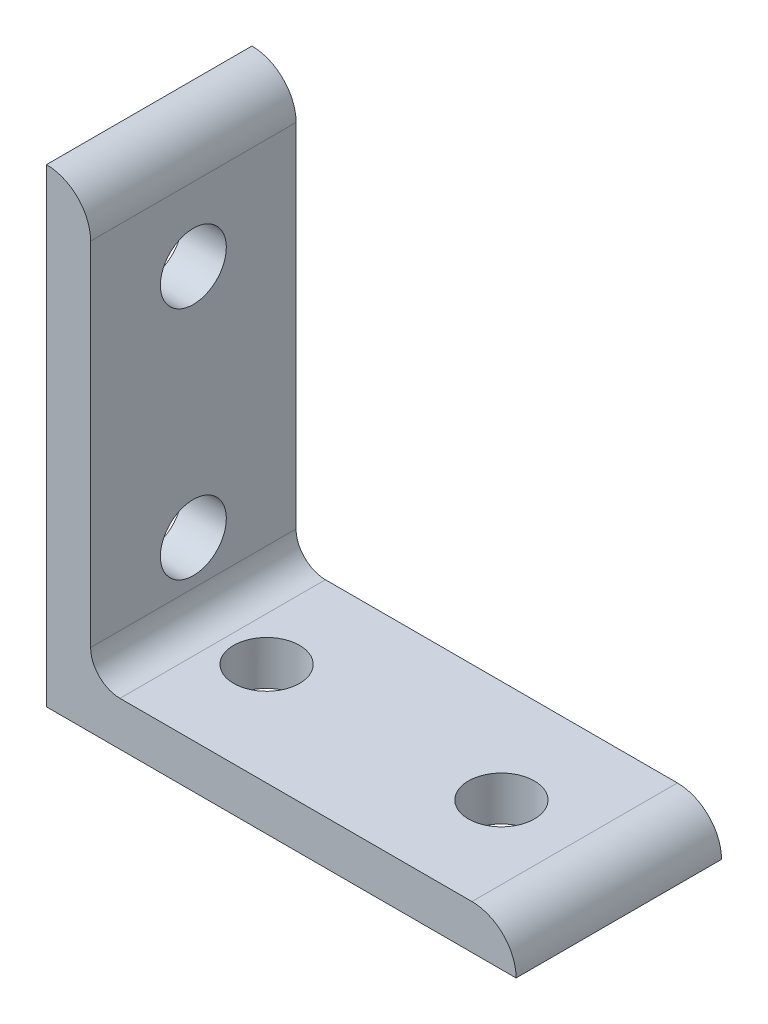
ISO-10303-21;
HEADER;
FILE_DESCRIPTION(('STEP AP214'),'2;1');
FILE_NAME('part.step','',(''),(''),'','','');
FILE_SCHEMA(('AUTOMOTIVE_DESIGN { 1 0 10303 214 1 1 1 1 }'));
ENDSEC;
DATA;
#1=APPLICATION_CONTEXT('core data for automotive mechanical design processes');
#2=APPLICATION_PROTOCOL_DEFINITION('international standard','automotive_design',2000,#1);
#3=PRODUCT_CONTEXT('',#1,'mechanical');
#4=PRODUCT('Part','Part','',(#3));
#5=PRODUCT_RELATED_PRODUCT_CATEGORY('part','',(#4));
#6=PRODUCT_DEFINITION_FORMATION('','',#4);
#7=PRODUCT_DEFINITION_CONTEXT('part definition',#1,'design');
#8=PRODUCT_DEFINITION('design','',#6,#7);
#9=PRODUCT_DEFINITION_SHAPE('','',#8);
#10=(LENGTH_UNIT() NAMED_UNIT(*) SI_UNIT(.MILLI.,.METRE.));
#11=(NAMED_UNIT(*) PLANE_ANGLE_UNIT() SI_UNIT($,.RADIAN.));
#12=(NAMED_UNIT(*) SI_UNIT($,.STERADIAN.) SOLID_ANGLE_UNIT());
#13=UNCERTAINTY_MEASURE_WITH_UNIT(LENGTH_MEASURE(1.E-05),#10,'distance_accuracy_value','');
#14=(GEOMETRIC_REPRESENTATION_CONTEXT(3) GLOBAL_UNCERTAINTY_ASSIGNED_CONTEXT((#13)) GLOBAL_UNIT_ASSIGNED_CONTEXT((#10,
#11,#12)) REPRESENTATION_CONTEXT('',''));
#15=CARTESIAN_POINT('',(0.,0.,0.));
#16=DIRECTION('',(0.,0.,1.));
#17=DIRECTION('',(1.,0.,0.));
#18=AXIS2_PLACEMENT_3D('',#15,#16,#17);
#19=CARTESIAN_POINT('',(4.7752,46.0248,11.1125));
#20=DIRECTION('',(-1.,0.,0.));
#21=DIRECTION('',(0.,-1.,0.));
#22=AXIS2_PLACEMENT_3D('',#19,#20,#21);
#23=PLANE('',#22);
#24=CARTESIAN_POINT('',(4.7752,12.7,0.));
#25=DIRECTION('',(-1.,0.,0.));
#26=DIRECTION('',(0.,-1.,0.));
#27=AXIS2_PLACEMENT_3D('',#24,#25,#26);
#28=CIRCLE('',#27,3.5687);
#29=CARTESIAN_POINT('',(4.7752,9.1313,0.));
#30=VERTEX_POINT('',#29);
#31=EDGE_CURVE('E196',#30,#30,#28,.F.);
#32=ORIENTED_EDGE('',*,*,#31,.F.);
#33=EDGE_LOOP('',(#32));
#34=FACE_BOUND('',#33,.T.);
#35=DIRECTION('',(0.,1.,0.));
#36=VECTOR('',#35,1.);
#37=CARTESIAN_POINT('',(4.7752,46.0248,-11.1125));
#38=LINE('',#37,#36);
#39=CARTESIAN_POINT('',(4.7752,7.9502,-11.1125));
#40=VERTEX_POINT('',#39);
#41=CARTESIAN_POINT('',(4.77519999999999,46.0248,-11.1125));
#42=VERTEX_POINT('',#41);
#43=EDGE_CURVE('E117',#40,#42,#38,.T.);
#44=ORIENTED_EDGE('',*,*,#43,.T.);
#45=DIRECTION('',(0.,0.,-1.));
#46=VECTOR('',#45,1.);
#47=CARTESIAN_POINT('',(4.77519999999999,46.0248,11.1125));
#48=LINE('',#47,#46);
#49=CARTESIAN_POINT('',(4.77519999999999,46.0248,11.1125));
#50=VERTEX_POINT('',#49);
#51=EDGE_CURVE('E114',#50,#42,#48,.T.);
#52=ORIENTED_EDGE('',*,*,#51,.F.);
#53=DIRECTION('',(0.,1.,0.));
#54=VECTOR('',#53,1.);
#55=CARTESIAN_POINT('',(4.7752,46.0248,11.1125));
#56=LINE('',#55,#54);
#57=CARTESIAN_POINT('',(4.7752,7.9502,11.1125));
#58=VERTEX_POINT('',#57);
#59=EDGE_CURVE('E103',#58,#50,#56,.T.);
#60=ORIENTED_EDGE('',*,*,#59,.F.);
#61=DIRECTION('',(0.,0.,-1.));
#62=VECTOR('',#61,1.);
#63=CARTESIAN_POINT('',(4.7752,7.9502,11.1125));
#64=LINE('',#63,#62);
#65=EDGE_CURVE('E118',#58,#40,#64,.T.);
#66=ORIENTED_EDGE('',*,*,#65,.T.);
#67=EDGE_LOOP('',(#44,#52,#60,#66));
#68=FACE_BOUND('',#67,.T.);
#69=CARTESIAN_POINT('',(4.77519999999999,38.1,0.));
#70=DIRECTION('',(-1.,0.,0.));
#71=DIRECTION('',(0.,-1.,0.));
#72=AXIS2_PLACEMENT_3D('',#69,#70,#71);
#73=CIRCLE('',#72,3.5687);
#74=CARTESIAN_POINT('',(4.77519999999999,34.5313,0.));
#75=VERTEX_POINT('',#74);
#76=EDGE_CURVE('E189',#75,#75,#73,.F.);
#77=ORIENTED_EDGE('',*,*,#76,.F.);
#78=EDGE_LOOP('',(#77));
#79=FACE_BOUND('',#78,.T.);
#80=ADVANCED_FACE('F34',(#34,#68,#79),#23,.F.);
#81=CARTESIAN_POINT('',(0.,0.,11.1125));
#82=DIRECTION('',(1.,0.,0.));
#83=DIRECTION('',(0.,0.,-1.));
#84=AXIS2_PLACEMENT_3D('',#81,#82,#83);
#85=PLANE('',#84);
#86=CARTESIAN_POINT('',(0.,12.7,0.));
#87=DIRECTION('',(1.,0.,0.));
#88=DIRECTION('',(0.,0.,-1.));
#89=AXIS2_PLACEMENT_3D('',#86,#87,#88);
#90=CIRCLE('',#89,3.5687);
#91=CARTESIAN_POINT('',(0.,12.7,-3.5687));
#92=VERTEX_POINT('',#91);
#93=EDGE_CURVE('E192',#92,#92,#90,.T.);
#94=ORIENTED_EDGE('',*,*,#93,.T.);
#95=EDGE_LOOP('',(#94));
#96=FACE_BOUND('',#95,.T.);
#97=DIRECTION('',(0.,-1.,0.));
#98=VECTOR('',#97,1.);
#99=CARTESIAN_POINT('',(0.,0.,-11.1125));
#100=LINE('',#99,#98);
#101=CARTESIAN_POINT('',(0.,50.8,-11.1125));
#102=VERTEX_POINT('',#101);
#103=CARTESIAN_POINT('',(0.,0.,-11.1125));
#104=VERTEX_POINT('',#103);
#105=EDGE_CURVE('E85',#102,#104,#100,.T.);
#106=ORIENTED_EDGE('',*,*,#105,.T.);
#107=DIRECTION('',(0.,0.,-1.));
#108=VECTOR('',#107,1.);
#109=CARTESIAN_POINT('',(0.,0.,11.1125));
#110=LINE('',#109,#108);
#111=CARTESIAN_POINT('',(0.,0.,11.1125));
#112=VERTEX_POINT('',#111);
#113=EDGE_CURVE('E123',#112,#104,#110,.T.);
#114=ORIENTED_EDGE('',*,*,#113,.F.);
#115=DIRECTION('',(0.,-1.,0.));
#116=VECTOR('',#115,1.);
#117=CARTESIAN_POINT('',(0.,0.,11.1125));
#118=LINE('',#117,#116);
#119=CARTESIAN_POINT('',(0.,50.8,11.1125));
#120=VERTEX_POINT('',#119);
#121=EDGE_CURVE('E53',#120,#112,#118,.T.);
#122=ORIENTED_EDGE('',*,*,#121,.F.);
#123=DIRECTION('',(0.,0.,-1.));
#124=VECTOR('',#123,1.);
#125=CARTESIAN_POINT('',(0.,50.8,11.1125));
#126=LINE('',#125,#124);
#127=EDGE_CURVE('E119',#120,#102,#126,.T.);
#128=ORIENTED_EDGE('',*,*,#127,.T.);
#129=EDGE_LOOP('',(#106,#114,#122,#128));
#130=FACE_BOUND('',#129,.T.);
#131=CARTESIAN_POINT('',(0.,38.1,0.));
#132=DIRECTION('',(1.,0.,0.));
#133=DIRECTION('',(0.,0.,-1.));
#134=AXIS2_PLACEMENT_3D('',#131,#132,#133);
#135=CIRCLE('',#134,3.5687);
#136=CARTESIAN_POINT('',(0.,38.1,-3.5687));
#137=VERTEX_POINT('',#136);
#138=EDGE_CURVE('E187',#137,#137,#135,.T.);
#139=ORIENTED_EDGE('',*,*,#138,.T.);
#140=EDGE_LOOP('',(#139));
#141=FACE_BOUND('',#140,.T.);
#142=ADVANCED_FACE('F180',(#96,#130,#141),#85,.F.);
#143=CARTESIAN_POINT('',(50.8,0.,11.1125));
#144=DIRECTION('',(0.,1.,0.));
#145=DIRECTION('',(-1.,0.,0.));
#146=AXIS2_PLACEMENT_3D('',#143,#144,#145);
#147=PLANE('',#146);
#148=CARTESIAN_POINT('',(12.7,0.,0.));
#149=DIRECTION('',(0.,1.,0.));
#150=DIRECTION('',(0.,0.,1.));
#151=AXIS2_PLACEMENT_3D('',#148,#149,#150);
#152=CIRCLE('',#151,3.5687);
#153=CARTESIAN_POINT('',(12.7,0.,3.5687));
#154=VERTEX_POINT('',#153);
#155=EDGE_CURVE('E149',#154,#154,#152,.T.);
#156=ORIENTED_EDGE('',*,*,#155,.T.);
#157=EDGE_LOOP('',(#156));
#158=FACE_BOUND('',#157,.T.);
#159=DIRECTION('',(1.,0.,0.));
#160=VECTOR('',#159,1.);
#161=CARTESIAN_POINT('',(50.8,0.,-11.1125));
#162=LINE('',#161,#160);
#163=CARTESIAN_POINT('',(50.8,0.,-11.1125));
#164=VERTEX_POINT('',#163);
#165=EDGE_CURVE('E127',#104,#164,#162,.T.);
#166=ORIENTED_EDGE('',*,*,#165,.T.);
#167=DIRECTION('',(0.,0.,-1.));
#168=VECTOR('',#167,1.);
#169=CARTESIAN_POINT('',(50.8,0.,11.1125));
#170=LINE('',#169,#168);
#171=CARTESIAN_POINT('',(50.8,0.,11.1125));
#172=VERTEX_POINT('',#171);
#173=EDGE_CURVE('E11',#172,#164,#170,.T.);
#174=ORIENTED_EDGE('',*,*,#173,.F.);
#175=DIRECTION('',(1.,0.,0.));
#176=VECTOR('',#175,1.);
#177=CARTESIAN_POINT('',(50.8,0.,11.1125));
#178=LINE('',#177,#176);
#179=EDGE_CURVE('E140',#112,#172,#178,.T.);
#180=ORIENTED_EDGE('',*,*,#179,.F.);
#181=ORIENTED_EDGE('',*,*,#113,.T.);
#182=EDGE_LOOP('',(#166,#174,#180,#181));
#183=FACE_BOUND('',#182,.T.);
#184=CARTESIAN_POINT('',(38.1,0.,0.));
#185=DIRECTION('',(0.,1.,0.));
#186=DIRECTION('',(0.,0.,1.));
#187=AXIS2_PLACEMENT_3D('',#184,#185,#186);
#188=CIRCLE('',#187,3.56869999999999);
#189=CARTESIAN_POINT('',(38.1,0.,3.56869999999999));
#190=VERTEX_POINT('',#189);
#191=EDGE_CURVE('E157',#190,#190,#188,.T.);
#192=ORIENTED_EDGE('',*,*,#191,.T.);
#193=EDGE_LOOP('',(#192));
#194=FACE_BOUND('',#193,.T.);
#195=ADVANCED_FACE('F36',(#158,#183,#194),#147,.F.);
#196=CARTESIAN_POINT('',(7.9502,4.7752,11.1125));
#197=DIRECTION('',(0.,-1.,0.));
#198=DIRECTION('',(1.,0.,0.));
#199=AXIS2_PLACEMENT_3D('',#196,#197,#198);
#200=PLANE('',#199);
#201=CARTESIAN_POINT('',(12.7,4.7752,0.));
#202=DIRECTION('',(0.,-1.,0.));
#203=DIRECTION('',(1.,0.,0.));
#204=AXIS2_PLACEMENT_3D('',#201,#202,#203);
#205=CIRCLE('',#204,3.5687);
#206=CARTESIAN_POINT('',(16.2687,4.7752,0.));
#207=VERTEX_POINT('',#206);
#208=EDGE_CURVE('E131',#207,#207,#205,.F.);
#209=ORIENTED_EDGE('',*,*,#208,.F.);
#210=EDGE_LOOP('',(#209));
#211=FACE_BOUND('',#210,.T.);
#212=DIRECTION('',(-1.,0.,0.));
#213=VECTOR('',#212,1.);
#214=CARTESIAN_POINT('',(7.9502,4.7752,-11.1125));
#215=LINE('',#214,#213);
#216=CARTESIAN_POINT('',(46.0248,4.7752,-11.1125));
#217=VERTEX_POINT('',#216);
#218=CARTESIAN_POINT('',(7.9502,4.7752,-11.1125));
#219=VERTEX_POINT('',#218);
#220=EDGE_CURVE('E133',#217,#219,#215,.T.);
#221=ORIENTED_EDGE('',*,*,#220,.T.);
#222=DIRECTION('',(0.,0.,-1.));
#223=VECTOR('',#222,1.);
#224=CARTESIAN_POINT('',(7.9502,4.7752,11.1125));
#225=LINE('',#224,#223);
#226=CARTESIAN_POINT('',(7.9502,4.7752,11.1125));
#227=VERTEX_POINT('',#226);
#228=EDGE_CURVE('E144',#227,#219,#225,.T.);
#229=ORIENTED_EDGE('',*,*,#228,.F.);
#230=DIRECTION('',(-1.,0.,0.));
#231=VECTOR('',#230,1.);
#232=CARTESIAN_POINT('',(7.9502,4.7752,11.1125));
#233=LINE('',#232,#231);
#234=CARTESIAN_POINT('',(46.0248,4.7752,11.1125));
#235=VERTEX_POINT('',#234);
#236=EDGE_CURVE('E163',#235,#227,#233,.T.);
#237=ORIENTED_EDGE('',*,*,#236,.F.);
#238=DIRECTION('',(0.,0.,-1.));
#239=VECTOR('',#238,1.);
#240=CARTESIAN_POINT('',(46.0248,4.7752,11.1125));
#241=LINE('',#240,#239);
#242=EDGE_CURVE('E44',#235,#217,#241,.T.);
#243=ORIENTED_EDGE('',*,*,#242,.T.);
#244=EDGE_LOOP('',(#221,#229,#237,#243));
#245=FACE_BOUND('',#244,.T.);
#246=CARTESIAN_POINT('',(38.1,4.7752,0.));
#247=DIRECTION('',(0.,-1.,0.));
#248=DIRECTION('',(1.,0.,0.));
#249=AXIS2_PLACEMENT_3D('',#246,#247,#248);
#250=CIRCLE('',#249,3.56869999999999);
#251=CARTESIAN_POINT('',(41.6687,4.7752,0.));
#252=VERTEX_POINT('',#251);
#253=EDGE_CURVE('E38',#252,#252,#250,.F.);
#254=ORIENTED_EDGE('',*,*,#253,.F.);
#255=EDGE_LOOP('',(#254));
#256=FACE_BOUND('',#255,.T.);
#257=ADVANCED_FACE('F167',(#211,#245,#256),#200,.F.);
#258=CARTESIAN_POINT('',(46.0248,0.,11.1125));
#259=DIRECTION('',(0.,0.,-1.));
#260=DIRECTION('',(-1.,0.,0.));
#261=AXIS2_PLACEMENT_3D('',#258,#259,#260);
#262=CYLINDRICAL_SURFACE('',#261,4.7752);
#263=CARTESIAN_POINT('',(46.0248,0.,-11.1125));
#264=DIRECTION('',(0.,0.,1.));
#265=DIRECTION('',(1.,0.,0.));
#266=AXIS2_PLACEMENT_3D('',#263,#264,#265);
#267=CIRCLE('',#266,4.7752);
#268=EDGE_CURVE('E130',#164,#217,#267,.T.);
#269=ORIENTED_EDGE('',*,*,#268,.T.);
#270=ORIENTED_EDGE('',*,*,#242,.F.);
#271=CARTESIAN_POINT('',(46.0248,0.,11.1125));
#272=DIRECTION('',(0.,0.,1.));
#273=DIRECTION('',(1.,0.,0.));
#274=AXIS2_PLACEMENT_3D('',#271,#272,#273);
#275=CIRCLE('',#274,4.7752);
#276=EDGE_CURVE('E93',#172,#235,#275,.T.);
#277=ORIENTED_EDGE('',*,*,#276,.F.);
#278=ORIENTED_EDGE('',*,*,#173,.T.);
#279=EDGE_LOOP('',(#269,#270,#277,#278));
#280=FACE_BOUND('',#279,.T.);
#281=ADVANCED_FACE('F211',(#280),#262,.T.);
#282=CARTESIAN_POINT('',(7.9502,7.9502,11.1125));
#283=DIRECTION('',(0.,0.,-1.));
#284=DIRECTION('',(-1.,0.,0.));
#285=AXIS2_PLACEMENT_3D('',#282,#283,#284);
#286=CYLINDRICAL_SURFACE('',#285,3.175);
#287=CARTESIAN_POINT('',(7.9502,7.9502,-11.1125));
#288=DIRECTION('',(0.,0.,-1.));
#289=DIRECTION('',(1.,0.,0.));
#290=AXIS2_PLACEMENT_3D('',#287,#288,#289);
#291=CIRCLE('',#290,3.175);
#292=EDGE_CURVE('E135',#219,#40,#291,.T.);
#293=ORIENTED_EDGE('',*,*,#292,.T.);
#294=ORIENTED_EDGE('',*,*,#65,.F.);
#295=CARTESIAN_POINT('',(7.9502,7.9502,11.1125));
#296=DIRECTION('',(0.,0.,-1.));
#297=DIRECTION('',(1.,0.,0.));
#298=AXIS2_PLACEMENT_3D('',#295,#296,#297);
#299=CIRCLE('',#298,3.175);
#300=EDGE_CURVE('E109',#227,#58,#299,.T.);
#301=ORIENTED_EDGE('',*,*,#300,.F.);
#302=ORIENTED_EDGE('',*,*,#228,.T.);
#303=EDGE_LOOP('',(#293,#294,#301,#302));
#304=FACE_BOUND('',#303,.T.);
#305=ADVANCED_FACE('F172',(#304),#286,.F.);
#306=CARTESIAN_POINT('',(0.,46.0248,11.1125));
#307=DIRECTION('',(0.,0.,-1.));
#308=DIRECTION('',(-1.,0.,0.));
#309=AXIS2_PLACEMENT_3D('',#306,#307,#308);
#310=CYLINDRICAL_SURFACE('',#309,4.77519999999999);
#311=CARTESIAN_POINT('',(0.,46.0248,-11.1125));
#312=DIRECTION('',(0.,0.,1.));
#313=DIRECTION('',(1.,0.,0.));
#314=AXIS2_PLACEMENT_3D('',#311,#312,#313);
#315=CIRCLE('',#314,4.77519999999999);
#316=EDGE_CURVE('E79',#42,#102,#315,.T.);
#317=ORIENTED_EDGE('',*,*,#316,.T.);
#318=ORIENTED_EDGE('',*,*,#127,.F.);
#319=CARTESIAN_POINT('',(0.,46.0248,11.1125));
#320=DIRECTION('',(0.,0.,1.));
#321=DIRECTION('',(1.,0.,0.));
#322=AXIS2_PLACEMENT_3D('',#319,#320,#321);
#323=CIRCLE('',#322,4.77519999999999);
#324=EDGE_CURVE('E107',#50,#120,#323,.T.);
#325=ORIENTED_EDGE('',*,*,#324,.F.);
#326=ORIENTED_EDGE('',*,*,#51,.T.);
#327=EDGE_LOOP('',(#317,#318,#325,#326));
#328=FACE_BOUND('',#327,.T.);
#329=ADVANCED_FACE('F121',(#328),#310,.T.);
#330=CARTESIAN_POINT('',(0.,46.0248,11.1125));
#331=DIRECTION('',(0.,0.,1.));
#332=DIRECTION('',(1.,0.,0.));
#333=AXIS2_PLACEMENT_3D('',#330,#331,#332);
#334=PLANE('',#333);
#335=ORIENTED_EDGE('',*,*,#179,.T.);
#336=ORIENTED_EDGE('',*,*,#276,.T.);
#337=ORIENTED_EDGE('',*,*,#236,.T.);
#338=ORIENTED_EDGE('',*,*,#300,.T.);
#339=ORIENTED_EDGE('',*,*,#59,.T.);
#340=ORIENTED_EDGE('',*,*,#324,.T.);
#341=ORIENTED_EDGE('',*,*,#121,.T.);
#342=EDGE_LOOP('',(#335,#336,#337,#338,#339,#340,#341));
#343=FACE_BOUND('',#342,.T.);
#344=ADVANCED_FACE('F105',(#343),#334,.T.);
#345=CARTESIAN_POINT('',(0.,46.0248,-11.1125));
#346=DIRECTION('',(0.,0.,1.));
#347=DIRECTION('',(1.,0.,0.));
#348=AXIS2_PLACEMENT_3D('',#345,#346,#347);
#349=PLANE('',#348);
#350=ORIENTED_EDGE('',*,*,#165,.F.);
#351=ORIENTED_EDGE('',*,*,#105,.F.);
#352=ORIENTED_EDGE('',*,*,#316,.F.);
#353=ORIENTED_EDGE('',*,*,#43,.F.);
#354=ORIENTED_EDGE('',*,*,#292,.F.);
#355=ORIENTED_EDGE('',*,*,#220,.F.);
#356=ORIENTED_EDGE('',*,*,#268,.F.);
#357=EDGE_LOOP('',(#350,#351,#352,#353,#354,#355,#356));
#358=FACE_BOUND('',#357,.T.);
#359=ADVANCED_FACE('F175',(#358),#349,.F.);
#360=CARTESIAN_POINT('',(12.7,50.8,0.));
#361=DIRECTION('',(0.,-1.,0.));
#362=DIRECTION('',(0.,0.,-1.));
#363=AXIS2_PLACEMENT_3D('',#360,#361,#362);
#364=CYLINDRICAL_SURFACE('',#363,3.5687);
#365=ORIENTED_EDGE('',*,*,#155,.F.);
#366=EDGE_LOOP('',(#365));
#367=FACE_BOUND('',#366,.T.);
#368=ORIENTED_EDGE('',*,*,#208,.T.);
#369=EDGE_LOOP('',(#368));
#370=FACE_BOUND('',#369,.T.);
#371=ADVANCED_FACE('F207',(#367,#370),#364,.F.);
#372=CARTESIAN_POINT('',(38.1,50.8,0.));
#373=DIRECTION('',(0.,-1.,0.));
#374=DIRECTION('',(0.,0.,-1.));
#375=AXIS2_PLACEMENT_3D('',#372,#373,#374);
#376=CYLINDRICAL_SURFACE('',#375,3.56869999999999);
#377=ORIENTED_EDGE('',*,*,#191,.F.);
#378=EDGE_LOOP('',(#377));
#379=FACE_BOUND('',#378,.T.);
#380=ORIENTED_EDGE('',*,*,#253,.T.);
#381=EDGE_LOOP('',(#380));
#382=FACE_BOUND('',#381,.T.);
#383=ADVANCED_FACE('F203',(#379,#382),#376,.F.);
#384=CARTESIAN_POINT('',(50.8,12.7,0.));
#385=DIRECTION('',(-1.,0.,0.));
#386=DIRECTION('',(0.,0.,1.));
#387=AXIS2_PLACEMENT_3D('',#384,#385,#386);
#388=CYLINDRICAL_SURFACE('',#387,3.5687);
#389=ORIENTED_EDGE('',*,*,#93,.F.);
#390=EDGE_LOOP('',(#389));
#391=FACE_BOUND('',#390,.T.);
#392=ORIENTED_EDGE('',*,*,#31,.T.);
#393=EDGE_LOOP('',(#392));
#394=FACE_BOUND('',#393,.T.);
#395=ADVANCED_FACE('F206',(#391,#394),#388,.F.);
#396=CARTESIAN_POINT('',(50.8,38.1,0.));
#397=DIRECTION('',(-1.,0.,0.));
#398=DIRECTION('',(0.,0.,1.));
#399=AXIS2_PLACEMENT_3D('',#396,#397,#398);
#400=CYLINDRICAL_SURFACE('',#399,3.5687);
#401=ORIENTED_EDGE('',*,*,#138,.F.);
#402=EDGE_LOOP('',(#401));
#403=FACE_BOUND('',#402,.T.);
#404=ORIENTED_EDGE('',*,*,#76,.T.);
#405=EDGE_LOOP('',(#404));
#406=FACE_BOUND('',#405,.T.);
#407=ADVANCED_FACE('F243',(#403,#406),#400,.F.);
#408=CLOSED_SHELL('',(#80,#142,#195,#257,#281,#305,#329,#344,#359,#371,#383,#395,#407));
#409=MANIFOLD_SOLID_BREP('B2',#408);
#410=ADVANCED_BREP_SHAPE_REPRESENTATION('',(#18,#409),#14);
#411=SHAPE_DEFINITION_REPRESENTATION(#9,#410);
ENDSEC;
END-ISO-10303-21;
